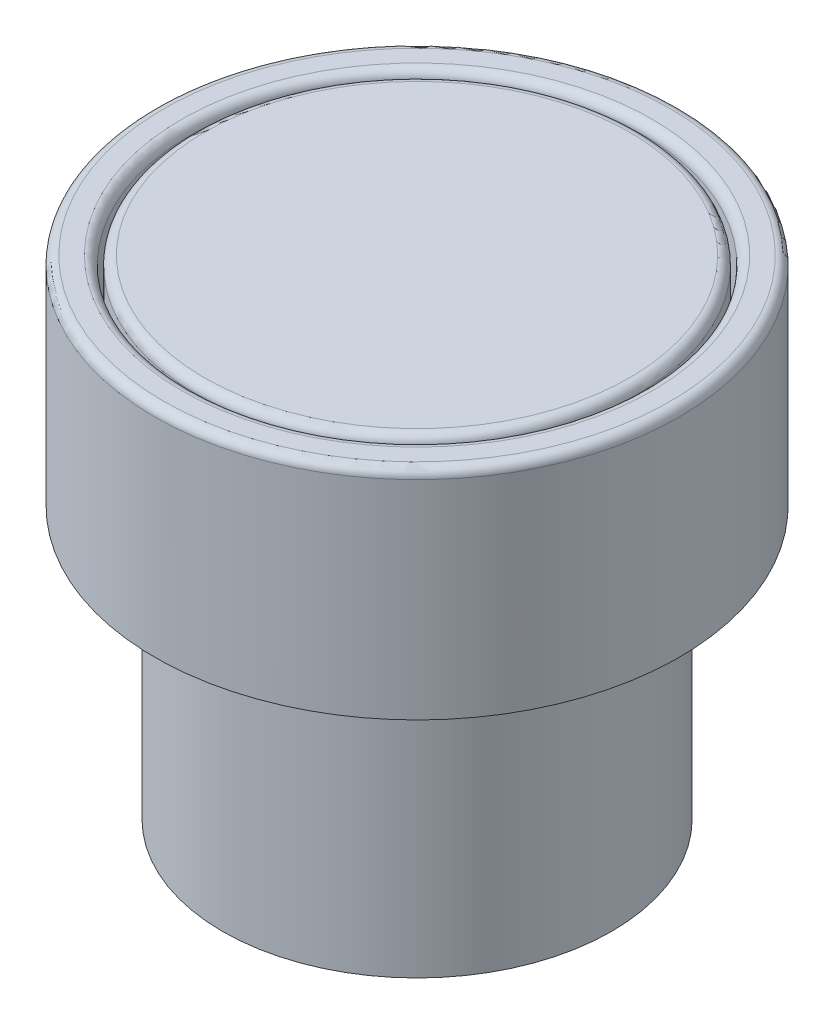
ISO-10303-21;
HEADER;
FILE_DESCRIPTION(('STEP AP214'),'2;1');
FILE_NAME('part.step','',(''),(''),'','','');
FILE_SCHEMA(('AUTOMOTIVE_DESIGN { 1 0 10303 214 1 1 1 1 }'));
ENDSEC;
DATA;
#1=APPLICATION_CONTEXT('core data for automotive mechanical design processes');
#2=APPLICATION_PROTOCOL_DEFINITION('international standard','automotive_design',2000,#1);
#3=PRODUCT_CONTEXT('',#1,'mechanical');
#4=PRODUCT('Part','Part','',(#3));
#5=PRODUCT_RELATED_PRODUCT_CATEGORY('part','',(#4));
#6=PRODUCT_DEFINITION_FORMATION('','',#4);
#7=PRODUCT_DEFINITION_CONTEXT('part definition',#1,'design');
#8=PRODUCT_DEFINITION('design','',#6,#7);
#9=PRODUCT_DEFINITION_SHAPE('','',#8);
#10=(LENGTH_UNIT() NAMED_UNIT(*) SI_UNIT(.MILLI.,.METRE.));
#11=(NAMED_UNIT(*) PLANE_ANGLE_UNIT() SI_UNIT($,.RADIAN.));
#12=(NAMED_UNIT(*) SI_UNIT($,.STERADIAN.) SOLID_ANGLE_UNIT());
#13=UNCERTAINTY_MEASURE_WITH_UNIT(LENGTH_MEASURE(1.E-05),#10,'distance_accuracy_value','');
#14=(GEOMETRIC_REPRESENTATION_CONTEXT(3) GLOBAL_UNCERTAINTY_ASSIGNED_CONTEXT((#13)) GLOBAL_UNIT_ASSIGNED_CONTEXT((#10,
#11,#12)) REPRESENTATION_CONTEXT('',''));
#15=CARTESIAN_POINT('',(0.,0.,0.));
#16=DIRECTION('',(0.,0.,1.));
#17=DIRECTION('',(1.,0.,0.));
#18=AXIS2_PLACEMENT_3D('',#15,#16,#17);
#19=CARTESIAN_POINT('',(0.,0.,0.));
#20=DIRECTION('',(0.,-1.,0.));
#21=DIRECTION('',(0.,0.,-1.));
#22=AXIS2_PLACEMENT_3D('',#19,#20,#21);
#23=PLANE('',#22);
#24=CARTESIAN_POINT('',(0.,0.,0.));
#25=DIRECTION('',(0.,1.,0.));
#26=DIRECTION('',(0.,0.,1.));
#27=AXIS2_PLACEMENT_3D('',#24,#25,#26);
#28=CIRCLE('',#27,12.5);
#29=CARTESIAN_POINT('',(0.,0.,12.5));
#30=VERTEX_POINT('',#29);
#31=EDGE_CURVE('E63',#30,#30,#28,.T.);
#32=ORIENTED_EDGE('',*,*,#31,.T.);
#33=EDGE_LOOP('',(#32));
#34=FACE_BOUND('',#33,.T.);
#35=CARTESIAN_POINT('',(0.,0.,0.));
#36=DIRECTION('',(0.,-1.,0.));
#37=DIRECTION('',(0.,0.,-1.));
#38=AXIS2_PLACEMENT_3D('',#35,#36,#37);
#39=CIRCLE('',#38,12.25);
#40=CARTESIAN_POINT('',(0.,0.,-12.25));
#41=VERTEX_POINT('',#40);
#42=EDGE_CURVE('E60',#41,#41,#39,.F.);
#43=ORIENTED_EDGE('',*,*,#42,.F.);
#44=EDGE_LOOP('',(#43));
#45=FACE_BOUND('',#44,.T.);
#46=ADVANCED_FACE('F34',(#34,#45),#23,.F.);
#47=CARTESIAN_POINT('',(0.,-1.,0.));
#48=DIRECTION('',(0.,-1.,0.));
#49=DIRECTION('',(0.,0.,-1.));
#50=AXIS2_PLACEMENT_3D('',#47,#48,#49);
#51=PLANE('',#50);
#52=CARTESIAN_POINT('',(0.,-1.,0.));
#53=DIRECTION('',(0.,-1.,0.));
#54=DIRECTION('',(0.,0.,-1.));
#55=AXIS2_PLACEMENT_3D('',#52,#53,#54);
#56=CIRCLE('',#55,14.5);
#57=CARTESIAN_POINT('',(0.,-1.,-14.5));
#58=VERTEX_POINT('',#57);
#59=EDGE_CURVE('E66',#58,#58,#56,.T.);
#60=ORIENTED_EDGE('',*,*,#59,.T.);
#61=EDGE_LOOP('',(#60));
#62=FACE_BOUND('',#61,.T.);
#63=CARTESIAN_POINT('',(0.,-1.,0.));
#64=DIRECTION('',(0.,-1.,0.));
#65=DIRECTION('',(0.,0.,-1.));
#66=AXIS2_PLACEMENT_3D('',#63,#64,#65);
#67=CIRCLE('',#66,10.75);
#68=CARTESIAN_POINT('',(0.,-1.,-10.75));
#69=VERTEX_POINT('',#68);
#70=EDGE_CURVE('E70',#69,#69,#67,.T.);
#71=ORIENTED_EDGE('',*,*,#70,.F.);
#72=EDGE_LOOP('',(#71));
#73=FACE_BOUND('',#72,.T.);
#74=ADVANCED_FACE('F85',(#62,#73),#51,.T.);
#75=CARTESIAN_POINT('',(0.,11.,0.));
#76=DIRECTION('',(0.,1.,0.));
#77=DIRECTION('',(0.,0.,1.));
#78=AXIS2_PLACEMENT_3D('',#75,#76,#77);
#79=PLANE('',#78);
#80=CARTESIAN_POINT('',(0.,11.,0.));
#81=DIRECTION('',(0.,1.,0.));
#82=DIRECTION('',(0.,0.,1.));
#83=AXIS2_PLACEMENT_3D('',#80,#81,#82);
#84=CIRCLE('',#83,14.);
#85=CARTESIAN_POINT('',(0.,11.,14.));
#86=VERTEX_POINT('',#85);
#87=EDGE_CURVE('E45',#86,#86,#84,.T.);
#88=ORIENTED_EDGE('',*,*,#87,.T.);
#89=EDGE_LOOP('',(#88));
#90=FACE_BOUND('',#89,.T.);
#91=CARTESIAN_POINT('',(0.,11.,0.));
#92=DIRECTION('',(0.,1.,0.));
#93=DIRECTION('',(0.,0.,1.));
#94=AXIS2_PLACEMENT_3D('',#91,#92,#93);
#95=CIRCLE('',#94,13.);
#96=CARTESIAN_POINT('',(0.,11.,13.));
#97=VERTEX_POINT('',#96);
#98=EDGE_CURVE('E49',#97,#97,#95,.F.);
#99=ORIENTED_EDGE('',*,*,#98,.T.);
#100=EDGE_LOOP('',(#99));
#101=FACE_BOUND('',#100,.T.);
#102=ADVANCED_FACE('F87',(#90,#101),#79,.T.);
#103=CARTESIAN_POINT('',(0.,11.,0.));
#104=DIRECTION('',(0.,-1.,0.));
#105=DIRECTION('',(0.,0.,-1.));
#106=AXIS2_PLACEMENT_3D('',#103,#104,#105);
#107=CYLINDRICAL_SURFACE('',#106,14.5);
#108=CARTESIAN_POINT('',(0.,10.5,0.));
#109=DIRECTION('',(0.,1.,0.));
#110=DIRECTION('',(0.,0.,1.));
#111=AXIS2_PLACEMENT_3D('',#108,#109,#110);
#112=CIRCLE('',#111,14.5);
#113=CARTESIAN_POINT('',(0.,10.5,14.5));
#114=VERTEX_POINT('',#113);
#115=EDGE_CURVE('E41',#114,#114,#112,.F.);
#116=ORIENTED_EDGE('',*,*,#115,.T.);
#117=EDGE_LOOP('',(#116));
#118=FACE_BOUND('',#117,.T.);
#119=ORIENTED_EDGE('',*,*,#59,.F.);
#120=EDGE_LOOP('',(#119));
#121=FACE_BOUND('',#120,.T.);
#122=ADVANCED_FACE('F94',(#118,#121),#107,.T.);
#123=CARTESIAN_POINT('',(0.,11.,0.));
#124=DIRECTION('',(0.,-1.,0.));
#125=DIRECTION('',(0.,0.,-1.));
#126=AXIS2_PLACEMENT_3D('',#123,#124,#125);
#127=CYLINDRICAL_SURFACE('',#126,12.5);
#128=CARTESIAN_POINT('',(0.,10.5,0.));
#129=DIRECTION('',(0.,1.,0.));
#130=DIRECTION('',(0.,0.,1.));
#131=AXIS2_PLACEMENT_3D('',#128,#129,#130);
#132=CIRCLE('',#131,12.5);
#133=CARTESIAN_POINT('',(0.,10.5,12.5));
#134=VERTEX_POINT('',#133);
#135=EDGE_CURVE('E10',#134,#134,#132,.T.);
#136=ORIENTED_EDGE('',*,*,#135,.T.);
#137=EDGE_LOOP('',(#136));
#138=FACE_BOUND('',#137,.T.);
#139=ORIENTED_EDGE('',*,*,#31,.F.);
#140=EDGE_LOOP('',(#139));
#141=FACE_BOUND('',#140,.T.);
#142=ADVANCED_FACE('F81',(#138,#141),#127,.F.);
#143=CARTESIAN_POINT('',(0.,-16.,0.));
#144=DIRECTION('',(0.,1.,0.));
#145=DIRECTION('',(0.,0.,1.));
#146=AXIS2_PLACEMENT_3D('',#143,#144,#145);
#147=CYLINDRICAL_SURFACE('',#146,10.75);
#148=CARTESIAN_POINT('',(0.,-16.,0.));
#149=DIRECTION('',(0.,-1.,0.));
#150=DIRECTION('',(0.,0.,-1.));
#151=AXIS2_PLACEMENT_3D('',#148,#149,#150);
#152=CIRCLE('',#151,10.75);
#153=CARTESIAN_POINT('',(0.,-16.,-10.75));
#154=VERTEX_POINT('',#153);
#155=EDGE_CURVE('E69',#154,#154,#152,.T.);
#156=ORIENTED_EDGE('',*,*,#155,.F.);
#157=EDGE_LOOP('',(#156));
#158=FACE_BOUND('',#157,.T.);
#159=ORIENTED_EDGE('',*,*,#70,.T.);
#160=EDGE_LOOP('',(#159));
#161=FACE_BOUND('',#160,.T.);
#162=ADVANCED_FACE('F78',(#158,#161),#147,.T.);
#163=CARTESIAN_POINT('',(0.,-16.,0.));
#164=DIRECTION('',(0.,-1.,0.));
#165=DIRECTION('',(0.,0.,-1.));
#166=AXIS2_PLACEMENT_3D('',#163,#164,#165);
#167=PLANE('',#166);
#168=ORIENTED_EDGE('',*,*,#155,.T.);
#169=EDGE_LOOP('',(#168));
#170=FACE_BOUND('',#169,.T.);
#171=ADVANCED_FACE('F76',(#170),#167,.T.);
#172=CARTESIAN_POINT('',(0.,45.6482322781408,0.));
#173=DIRECTION('',(0.,-1.,0.));
#174=DIRECTION('',(0.,0.,-1.));
#175=AXIS2_PLACEMENT_3D('',#172,#173,#174);
#176=CYLINDRICAL_SURFACE('',#175,12.25);
#177=CARTESIAN_POINT('',(0.,10.5,0.));
#178=DIRECTION('',(0.,1.,0.));
#179=DIRECTION('',(0.,0.,1.));
#180=AXIS2_PLACEMENT_3D('',#177,#178,#179);
#181=CIRCLE('',#180,12.25);
#182=CARTESIAN_POINT('',(0.,10.5,12.25));
#183=VERTEX_POINT('',#182);
#184=EDGE_CURVE('E54',#183,#183,#181,.F.);
#185=ORIENTED_EDGE('',*,*,#184,.T.);
#186=EDGE_LOOP('',(#185));
#187=FACE_BOUND('',#186,.T.);
#188=ORIENTED_EDGE('',*,*,#42,.T.);
#189=EDGE_LOOP('',(#188));
#190=FACE_BOUND('',#189,.T.);
#191=ADVANCED_FACE('F143',(#187,#190),#176,.T.);
#192=CARTESIAN_POINT('',(0.,11.,0.));
#193=DIRECTION('',(0.,1.,0.));
#194=DIRECTION('',(0.,0.,1.));
#195=AXIS2_PLACEMENT_3D('',#192,#193,#194);
#196=PLANE('',#195);
#197=CARTESIAN_POINT('',(0.,11.,0.));
#198=DIRECTION('',(0.,1.,0.));
#199=DIRECTION('',(0.,0.,1.));
#200=AXIS2_PLACEMENT_3D('',#197,#198,#199);
#201=CIRCLE('',#200,11.75);
#202=CARTESIAN_POINT('',(0.,11.,11.75));
#203=VERTEX_POINT('',#202);
#204=EDGE_CURVE('E57',#203,#203,#201,.T.);
#205=ORIENTED_EDGE('',*,*,#204,.T.);
#206=EDGE_LOOP('',(#205));
#207=FACE_BOUND('',#206,.T.);
#208=ADVANCED_FACE('F108',(#207),#196,.T.);
#209=CARTESIAN_POINT('',(0.,10.5,0.));
#210=DIRECTION('',(0.,1.,0.));
#211=DIRECTION('',(0.,0.,1.));
#212=AXIS2_PLACEMENT_3D('',#209,#210,#211);
#213=TOROIDAL_SURFACE('',#212,11.75,0.5);
#214=ORIENTED_EDGE('',*,*,#184,.F.);
#215=EDGE_LOOP('',(#214));
#216=FACE_BOUND('',#215,.T.);
#217=ORIENTED_EDGE('',*,*,#204,.F.);
#218=EDGE_LOOP('',(#217));
#219=FACE_BOUND('',#218,.T.);
#220=ADVANCED_FACE('F105',(#216,#219),#213,.T.);
#221=CARTESIAN_POINT('',(0.,10.5,0.));
#222=DIRECTION('',(0.,1.,0.));
#223=DIRECTION('',(0.,0.,1.));
#224=AXIS2_PLACEMENT_3D('',#221,#222,#223);
#225=TOROIDAL_SURFACE('',#224,14.,0.5);
#226=ORIENTED_EDGE('',*,*,#115,.F.);
#227=EDGE_LOOP('',(#226));
#228=FACE_BOUND('',#227,.T.);
#229=ORIENTED_EDGE('',*,*,#87,.F.);
#230=EDGE_LOOP('',(#229));
#231=FACE_BOUND('',#230,.T.);
#232=ADVANCED_FACE('F107',(#228,#231),#225,.T.);
#233=CARTESIAN_POINT('',(0.,10.5,0.));
#234=DIRECTION('',(0.,1.,0.));
#235=DIRECTION('',(0.,0.,1.));
#236=AXIS2_PLACEMENT_3D('',#233,#234,#235);
#237=TOROIDAL_SURFACE('',#236,13.,0.5);
#238=ORIENTED_EDGE('',*,*,#98,.F.);
#239=EDGE_LOOP('',(#238));
#240=FACE_BOUND('',#239,.T.);
#241=ORIENTED_EDGE('',*,*,#135,.F.);
#242=EDGE_LOOP('',(#241));
#243=FACE_BOUND('',#242,.T.);
#244=ADVANCED_FACE('F36',(#240,#243),#237,.T.);
#245=CLOSED_SHELL('',(#46,#74,#102,#122,#142,#162,#171,#191,#208,#220,#232,#244));
#246=MANIFOLD_SOLID_BREP('B2',#245);
#247=ADVANCED_BREP_SHAPE_REPRESENTATION('',(#18,#246),#14);
#248=SHAPE_DEFINITION_REPRESENTATION(#9,#247);
ENDSEC;
END-ISO-10303-21;
